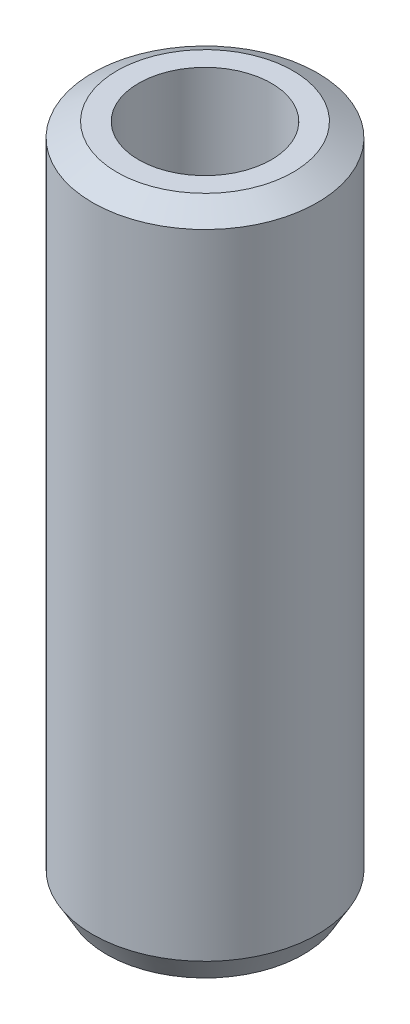
ISO-10303-21;
HEADER;
FILE_DESCRIPTION(('STEP AP214'),'2;1');
FILE_NAME('part.step','',(''),(''),'','','');
FILE_SCHEMA(('AUTOMOTIVE_DESIGN { 1 0 10303 214 1 1 1 1 }'));
ENDSEC;
DATA;
#1=APPLICATION_CONTEXT('core data for automotive mechanical design processes');
#2=APPLICATION_PROTOCOL_DEFINITION('international standard','automotive_design',2000,#1);
#3=PRODUCT_CONTEXT('',#1,'mechanical');
#4=PRODUCT('Part','Part','',(#3));
#5=PRODUCT_RELATED_PRODUCT_CATEGORY('part','',(#4));
#6=PRODUCT_DEFINITION_FORMATION('','',#4);
#7=PRODUCT_DEFINITION_CONTEXT('part definition',#1,'design');
#8=PRODUCT_DEFINITION('design','',#6,#7);
#9=PRODUCT_DEFINITION_SHAPE('','',#8);
#10=(LENGTH_UNIT() NAMED_UNIT(*) SI_UNIT(.MILLI.,.METRE.));
#11=(NAMED_UNIT(*) PLANE_ANGLE_UNIT() SI_UNIT($,.RADIAN.));
#12=(NAMED_UNIT(*) SI_UNIT($,.STERADIAN.) SOLID_ANGLE_UNIT());
#13=UNCERTAINTY_MEASURE_WITH_UNIT(LENGTH_MEASURE(1.E-05),#10,'distance_accuracy_value','');
#14=(GEOMETRIC_REPRESENTATION_CONTEXT(3) GLOBAL_UNCERTAINTY_ASSIGNED_CONTEXT((#13)) GLOBAL_UNIT_ASSIGNED_CONTEXT((#10,
#11,#12)) REPRESENTATION_CONTEXT('',''));
#15=CARTESIAN_POINT('',(0.,0.,0.));
#16=DIRECTION('',(0.,0.,1.));
#17=DIRECTION('',(1.,0.,0.));
#18=AXIS2_PLACEMENT_3D('',#15,#16,#17);
#19=CARTESIAN_POINT('',(0.,164.463908995109,0.));
#20=DIRECTION('',(0.,-1.,0.));
#21=DIRECTION('',(0.,0.,-1.));
#22=AXIS2_PLACEMENT_3D('',#19,#20,#21);
#23=CYLINDRICAL_SURFACE('',#22,27.5);
#24=CARTESIAN_POINT('',(0.,161.019662620339,0.));
#25=DIRECTION('',(0.,1.,0.));
#26=DIRECTION('',(0.,0.,1.));
#27=AXIS2_PLACEMENT_3D('',#24,#25,#26);
#28=CIRCLE('',#27,27.5);
#29=CARTESIAN_POINT('',(0.,161.019662620339,27.5));
#30=VERTEX_POINT('',#29);
#31=EDGE_CURVE('E50',#30,#30,#28,.F.);
#32=ORIENTED_EDGE('',*,*,#31,.T.);
#33=EDGE_LOOP('',(#32));
#34=FACE_BOUND('',#33,.T.);
#35=CARTESIAN_POINT('',(0.,5.9656097148868,0.));
#36=DIRECTION('',(0.,1.,0.));
#37=DIRECTION('',(0.,0.,1.));
#38=AXIS2_PLACEMENT_3D('',#35,#36,#37);
#39=CIRCLE('',#38,27.5);
#40=CARTESIAN_POINT('',(0.,5.9656097148868,27.5));
#41=VERTEX_POINT('',#40);
#42=EDGE_CURVE('E51',#41,#41,#39,.T.);
#43=ORIENTED_EDGE('',*,*,#42,.T.);
#44=EDGE_LOOP('',(#43));
#45=FACE_BOUND('',#44,.T.);
#46=ADVANCED_FACE('F39',(#34,#45),#23,.T.);
#47=CARTESIAN_POINT('',(0.,164.463908995109,0.));
#48=DIRECTION('',(0.,1.,0.));
#49=DIRECTION('',(0.,0.,1.));
#50=AXIS2_PLACEMENT_3D('',#47,#48,#49);
#51=PLANE('',#50);
#52=CARTESIAN_POINT('',(0.,164.463908995109,0.));
#53=DIRECTION('',(0.,1.,0.));
#54=DIRECTION('',(0.,0.,1.));
#55=AXIS2_PLACEMENT_3D('',#52,#53,#54);
#56=CIRCLE('',#55,21.5343902851133);
#57=CARTESIAN_POINT('',(0.,164.463908995109,21.5343902851133));
#58=VERTEX_POINT('',#57);
#59=EDGE_CURVE('E54',#58,#58,#56,.T.);
#60=ORIENTED_EDGE('',*,*,#59,.T.);
#61=EDGE_LOOP('',(#60));
#62=FACE_BOUND('',#61,.T.);
#63=CARTESIAN_POINT('',(0.,164.463908995109,0.));
#64=DIRECTION('',(0.,1.,0.));
#65=DIRECTION('',(0.,0.,1.));
#66=AXIS2_PLACEMENT_3D('',#63,#64,#65);
#67=CIRCLE('',#66,16.233978632621);
#68=CARTESIAN_POINT('',(0.,164.463908995109,16.233978632621));
#69=VERTEX_POINT('',#68);
#70=EDGE_CURVE('E58',#69,#69,#67,.T.);
#71=ORIENTED_EDGE('',*,*,#70,.F.);
#72=EDGE_LOOP('',(#71));
#73=FACE_BOUND('',#72,.T.);
#74=ADVANCED_FACE('F69',(#62,#73),#51,.T.);
#75=CARTESIAN_POINT('',(0.,0.,0.));
#76=DIRECTION('',(0.,1.,0.));
#77=DIRECTION('',(0.,0.,1.));
#78=AXIS2_PLACEMENT_3D('',#75,#76,#77);
#79=PLANE('',#78);
#80=CARTESIAN_POINT('',(0.,0.,0.));
#81=DIRECTION('',(0.,1.,0.));
#82=DIRECTION('',(0.,0.,1.));
#83=AXIS2_PLACEMENT_3D('',#80,#81,#82);
#84=CIRCLE('',#83,24.0557536252298);
#85=CARTESIAN_POINT('',(0.,0.,24.0557536252298));
#86=VERTEX_POINT('',#85);
#87=EDGE_CURVE('E10',#86,#86,#84,.F.);
#88=ORIENTED_EDGE('',*,*,#87,.T.);
#89=EDGE_LOOP('',(#88));
#90=FACE_BOUND('',#89,.T.);
#91=CARTESIAN_POINT('',(0.,0.,0.));
#92=DIRECTION('',(0.,1.,0.));
#93=DIRECTION('',(0.,0.,1.));
#94=AXIS2_PLACEMENT_3D('',#91,#92,#93);
#95=CIRCLE('',#94,16.233978632621);
#96=CARTESIAN_POINT('',(0.,0.,16.233978632621));
#97=VERTEX_POINT('',#96);
#98=EDGE_CURVE('E63',#97,#97,#95,.T.);
#99=ORIENTED_EDGE('',*,*,#98,.T.);
#100=EDGE_LOOP('',(#99));
#101=FACE_BOUND('',#100,.T.);
#102=ADVANCED_FACE('F75',(#90,#101),#79,.F.);
#103=CARTESIAN_POINT('',(0.,164.463908995109,0.));
#104=DIRECTION('',(0.,-1.,0.));
#105=DIRECTION('',(0.,0.,-1.));
#106=AXIS2_PLACEMENT_3D('',#103,#104,#105);
#107=CYLINDRICAL_SURFACE('',#106,16.233978632621);
#108=ORIENTED_EDGE('',*,*,#70,.T.);
#109=EDGE_LOOP('',(#108));
#110=FACE_BOUND('',#109,.T.);
#111=ORIENTED_EDGE('',*,*,#98,.F.);
#112=EDGE_LOOP('',(#111));
#113=FACE_BOUND('',#112,.T.);
#114=ADVANCED_FACE('F70',(#110,#113),#107,.F.);
#115=CARTESIAN_POINT('',(0.,164.463908995109,0.));
#116=DIRECTION('',(0.,-1.,0.));
#117=DIRECTION('',(0.,0.,-1.));
#118=AXIS2_PLACEMENT_3D('',#115,#116,#117);
#119=CONICAL_SURFACE('',#118,21.5343902851133,1.0471975511966);
#120=ORIENTED_EDGE('',*,*,#31,.F.);
#121=EDGE_LOOP('',(#120));
#122=FACE_BOUND('',#121,.T.);
#123=ORIENTED_EDGE('',*,*,#59,.F.);
#124=EDGE_LOOP('',(#123));
#125=FACE_BOUND('',#124,.T.);
#126=ADVANCED_FACE('F81',(#122,#125),#119,.T.);
#127=CARTESIAN_POINT('',(0.,5.9656097148868,0.));
#128=DIRECTION('',(0.,1.,0.));
#129=DIRECTION('',(0.,0.,1.));
#130=AXIS2_PLACEMENT_3D('',#127,#128,#129);
#131=CONICAL_SURFACE('',#130,27.5,0.523598775598302);
#132=CARTESIAN_POINT('',(0.,0.,24.0557536252298));
#133=CARTESIAN_POINT('',(0.,0.0621417678634033,24.0916311916337));
#134=CARTESIAN_POINT('',(0.,0.124283535726807,24.1275087580376));
#135=CARTESIAN_POINT('',(0.,0.248567071453616,24.1992638908453));
#136=CARTESIAN_POINT('',(0.,0.31070883931702,24.2351414572491));
#137=CARTESIAN_POINT('',(0.,0.434992375043828,24.3068965900568));
#138=CARTESIAN_POINT('',(0.,0.497134142907232,24.3427741564607));
#139=CARTESIAN_POINT('',(0.,0.621417678634041,24.4145292892684));
#140=CARTESIAN_POINT('',(0.,0.683559446497445,24.4504068556723));
#141=CARTESIAN_POINT('',(0.,0.807842982224253,24.52216198848));
#142=CARTESIAN_POINT('',(0.,0.869984750087657,24.5580395548838));
#143=CARTESIAN_POINT('',(0.,0.994268285814465,24.6297946876915));
#144=CARTESIAN_POINT('',(0.,1.05641005367787,24.6656722540954));
#145=CARTESIAN_POINT('',(0.,1.18069358940468,24.7374273869031));
#146=CARTESIAN_POINT('',(0.,1.24283535726808,24.773304953307));
#147=CARTESIAN_POINT('',(0.,1.36711889299489,24.8450600861147));
#148=CARTESIAN_POINT('',(0.,1.42926066085829,24.8809376525185));
#149=CARTESIAN_POINT('',(0.,1.5535441965851,24.9526927853262));
#150=CARTESIAN_POINT('',(0.,1.61568596444851,24.9885703517301));
#151=CARTESIAN_POINT('',(0.,1.73996950017532,25.0603254845378));
#152=CARTESIAN_POINT('',(0.,1.80211126803872,25.0962030509417));
#153=CARTESIAN_POINT('',(0.,1.92639480376553,25.1679581837494));
#154=CARTESIAN_POINT('',(0.,1.98853657162893,25.2038357501532));
#155=CARTESIAN_POINT('',(0.,2.11282010735574,25.2755908829609));
#156=CARTESIAN_POINT('',(0.,2.17496187521914,25.3114684493648));
#157=CARTESIAN_POINT('',(0.,2.29924541094595,25.3832235821725));
#158=CARTESIAN_POINT('',(0.,2.36138717880936,25.4191011485764));
#159=CARTESIAN_POINT('',(0.,2.48567071453617,25.4908562813841));
#160=CARTESIAN_POINT('',(0.,2.54781248239957,25.5267338477879));
#161=CARTESIAN_POINT('',(0.,2.67209601812638,25.5984889805956));
#162=CARTESIAN_POINT('',(0.,2.73423778598978,25.6343665469995));
#163=CARTESIAN_POINT('',(0.,2.85852132171659,25.7061216798072));
#164=CARTESIAN_POINT('',(0.,2.92066308957999,25.7419992462111));
#165=CARTESIAN_POINT('',(0.,3.0449466253068,25.8137543790188));
#166=CARTESIAN_POINT('',(0.,3.10708839317021,25.8496319454226));
#167=CARTESIAN_POINT('',(0.,3.23137192889702,25.9213870782303));
#168=CARTESIAN_POINT('',(0.,3.29351369676042,25.9572646446342));
#169=CARTESIAN_POINT('',(0.,3.41779723248723,26.0290197774419));
#170=CARTESIAN_POINT('',(0.,3.47993900035063,26.0648973438458));
#171=CARTESIAN_POINT('',(0.,3.60422253607744,26.1366524766535));
#172=CARTESIAN_POINT('',(0.,3.66636430394084,26.1725300430573));
#173=CARTESIAN_POINT('',(0.,3.79064783966765,26.244285175865));
#174=CARTESIAN_POINT('',(0.,3.85278960753106,26.2801627422689));
#175=CARTESIAN_POINT('',(0.,3.97707314325787,26.3519178750766));
#176=CARTESIAN_POINT('',(0.,4.03921491112127,26.3877954414805));
#177=CARTESIAN_POINT('',(0.,4.16349844684808,26.4595505742882));
#178=CARTESIAN_POINT('',(0.,4.22564021471148,26.495428140692));
#179=CARTESIAN_POINT('',(0.,4.34992375043829,26.5671832734997));
#180=CARTESIAN_POINT('',(0.,4.4120655183017,26.6030608399036));
#181=CARTESIAN_POINT('',(0.,4.5363490540285,26.6748159727113));
#182=CARTESIAN_POINT('',(0.,4.59849082189191,26.7106935391152));
#183=CARTESIAN_POINT('',(0.,4.72277435761872,26.7824486719229));
#184=CARTESIAN_POINT('',(0.,4.78491612548212,26.8183262383267));
#185=CARTESIAN_POINT('',(0.,4.90919966120893,26.8900813711345));
#186=CARTESIAN_POINT('',(0.,4.97134142907233,26.9259589375383));
#187=CARTESIAN_POINT('',(0.,5.09562496479914,26.997714070346));
#188=CARTESIAN_POINT('',(0.,5.15776673266255,27.0335916367499));
#189=CARTESIAN_POINT('',(0.,5.28205026838935,27.1053467695576));
#190=CARTESIAN_POINT('',(0.,5.34419203625276,27.1412243359614));
#191=CARTESIAN_POINT('',(0.,5.46847557197957,27.2129794687692));
#192=CARTESIAN_POINT('',(0.,5.53061733984297,27.248857035173));
#193=CARTESIAN_POINT('',(0.,5.65490087556978,27.3206121679807));
#194=CARTESIAN_POINT('',(0.,5.71704264343318,27.3564897343846));
#195=CARTESIAN_POINT('',(0.,5.84132617915999,27.4282448671923));
#196=CARTESIAN_POINT('',(0.,5.9034679470234,27.4641224335961));
#197=CARTESIAN_POINT('',(0.,5.9656097148868,27.5));
#198=B_SPLINE_CURVE_WITH_KNOTS('',3,(#132,#133,#134,#135,#136,#137,#138,#139,#140,#141,#142,
#143,#144,#145,#146,#147,#148,#149,#150,#151,#152,#153,#154,#155,#156,#157,#158,#159,#160,#161,
#162,#163,#164,#165,#166,#167,#168,#169,#170,#171,#172,#173,#174,#175,#176,#177,#178,#179,#180,
#181,#182,#183,#184,#185,#186,#187,#188,#189,#190,#191,#192,#193,#194,#195,#196,#197),
.UNSPECIFIED.,.F.,.F.,(4,2,2,2,2,2,2,2,2,2,2,2,2,2,2,2,2,2,2,2,2,2,2,2,2,2,2,2,2,2,2,2,4),(0.,
0.215265398423134,0.430530796846268,0.645796195269401,0.861061593692535,1.07632699211567,
1.2915923905388,1.50685778896194,1.72212318738507,1.93738858580821,2.15265398423134,
2.36791938265448,2.58318478107761,2.79845017950074,3.01371557792388,3.22898097634701,
3.44424637477015,3.65951177319328,3.87477717161641,4.09004257003955,4.30530796846268,
4.52057336688582,4.73583876530895,4.95110416373209,5.16636956215522,5.38163496057836,
5.59690035900149,5.81216575742462,6.02743115584776,6.24269655427089,6.45796195269403,
6.67322735111716,6.8884927495403),.UNSPECIFIED.);
#199=EDGE_CURVE('BSEAM45',#86,#41,#198,.T.);
#200=ORIENTED_EDGE('',*,*,#87,.F.);
#201=ORIENTED_EDGE('',*,*,#42,.F.);
#202=ORIENTED_EDGE('',*,*,#199,.T.);
#203=ORIENTED_EDGE('',*,*,#199,.F.);
#204=EDGE_LOOP('',(#200,#202,#201,#203));
#205=FACE_BOUND('',#204,.T.);
#206=ADVANCED_FACE('F45',(#205),#131,.T.);
#207=CLOSED_SHELL('',(#46,#74,#102,#114,#126,#206));
#208=MANIFOLD_SOLID_BREP('B2',#207);
#209=ADVANCED_BREP_SHAPE_REPRESENTATION('',(#18,#208),#14);
#210=SHAPE_DEFINITION_REPRESENTATION(#9,#209);
ENDSEC;
END-ISO-10303-21;
